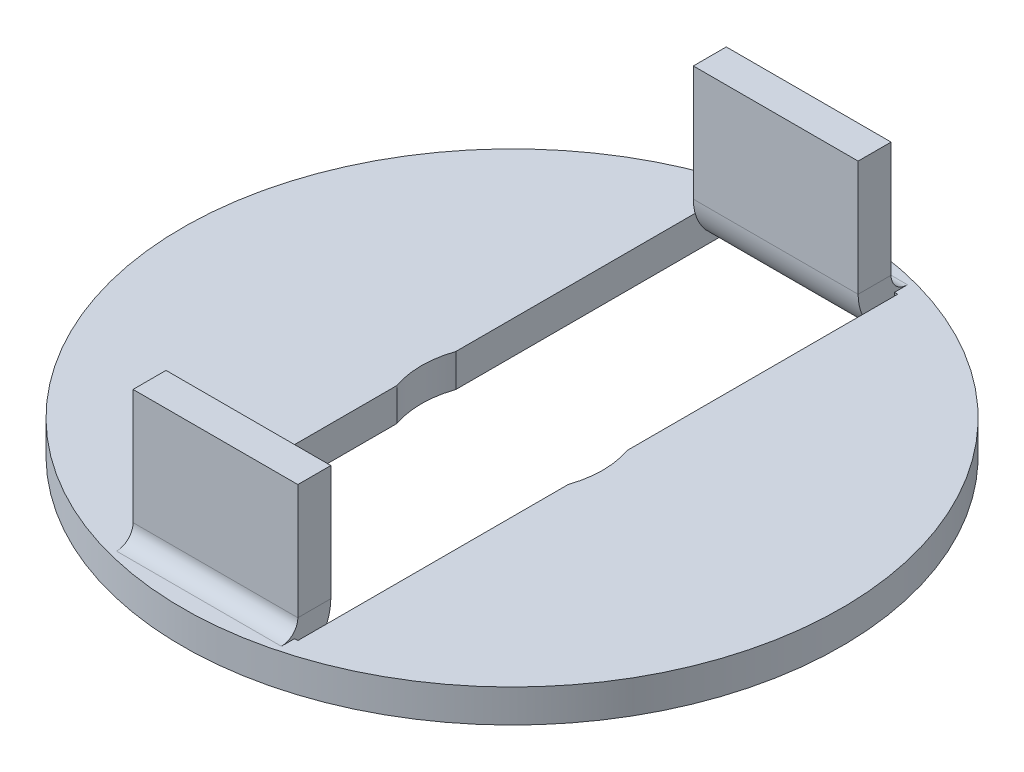
ISO-10303-21;
HEADER;
FILE_DESCRIPTION(('STEP AP214'),'2;1');
FILE_NAME('part.step','',(''),(''),'','','');
FILE_SCHEMA(('AUTOMOTIVE_DESIGN { 1 0 10303 214 1 1 1 1 }'));
ENDSEC;
DATA;
#1=APPLICATION_CONTEXT('core data for automotive mechanical design processes');
#2=APPLICATION_PROTOCOL_DEFINITION('international standard','automotive_design',2000,#1);
#3=PRODUCT_CONTEXT('',#1,'mechanical');
#4=PRODUCT('Part','Part','',(#3));
#5=PRODUCT_RELATED_PRODUCT_CATEGORY('part','',(#4));
#6=PRODUCT_DEFINITION_FORMATION('','',#4);
#7=PRODUCT_DEFINITION_CONTEXT('part definition',#1,'design');
#8=PRODUCT_DEFINITION('design','',#6,#7);
#9=PRODUCT_DEFINITION_SHAPE('','',#8);
#10=(LENGTH_UNIT() NAMED_UNIT(*) SI_UNIT(.MILLI.,.METRE.));
#11=(NAMED_UNIT(*) PLANE_ANGLE_UNIT() SI_UNIT($,.RADIAN.));
#12=(NAMED_UNIT(*) SI_UNIT($,.STERADIAN.) SOLID_ANGLE_UNIT());
#13=UNCERTAINTY_MEASURE_WITH_UNIT(LENGTH_MEASURE(1.E-05),#10,'distance_accuracy_value','');
#14=(GEOMETRIC_REPRESENTATION_CONTEXT(3) GLOBAL_UNCERTAINTY_ASSIGNED_CONTEXT((#13)) GLOBAL_UNIT_ASSIGNED_CONTEXT((#10,
#11,#12)) REPRESENTATION_CONTEXT('',''));
#15=CARTESIAN_POINT('',(0.,0.,0.));
#16=DIRECTION('',(0.,0.,1.));
#17=DIRECTION('',(1.,0.,0.));
#18=AXIS2_PLACEMENT_3D('',#15,#16,#17);
#19=CARTESIAN_POINT('',(-2.5,4.,-8.));
#20=DIRECTION('',(0.,0.,-1.));
#21=DIRECTION('',(-1.,0.,0.));
#22=AXIS2_PLACEMENT_3D('',#19,#20,#21);
#23=PLANE('',#22);
#24=DIRECTION('',(-1.,0.,0.));
#25=VECTOR('',#24,1.);
#26=CARTESIAN_POINT('',(-2.5,0.499999999999998,-8.));
#27=LINE('',#26,#25);
#28=CARTESIAN_POINT('',(-2.5,0.499999999999998,-8.));
#29=VERTEX_POINT('',#28);
#30=CARTESIAN_POINT('',(2.5,0.499999999999998,-8.));
#31=VERTEX_POINT('',#30);
#32=EDGE_CURVE('E373',#29,#31,#27,.F.);
#33=ORIENTED_EDGE('',*,*,#32,.T.);
#34=DIRECTION('',(0.,-1.,0.));
#35=VECTOR('',#34,1.);
#36=CARTESIAN_POINT('',(2.5,4.,-8.));
#37=LINE('',#36,#35);
#38=CARTESIAN_POINT('',(2.5,4.,-8.));
#39=VERTEX_POINT('',#38);
#40=EDGE_CURVE('E11',#39,#31,#37,.T.);
#41=ORIENTED_EDGE('',*,*,#40,.F.);
#42=DIRECTION('',(1.,0.,0.));
#43=VECTOR('',#42,1.);
#44=CARTESIAN_POINT('',(-2.5,4.,-8.));
#45=LINE('',#44,#43);
#46=CARTESIAN_POINT('',(-2.5,4.,-8.));
#47=VERTEX_POINT('',#46);
#48=EDGE_CURVE('E393',#47,#39,#45,.T.);
#49=ORIENTED_EDGE('',*,*,#48,.F.);
#50=DIRECTION('',(0.,-1.,0.));
#51=VECTOR('',#50,1.);
#52=CARTESIAN_POINT('',(-2.5,4.,-8.));
#53=LINE('',#52,#51);
#54=EDGE_CURVE('E51',#47,#29,#53,.T.);
#55=ORIENTED_EDGE('',*,*,#54,.T.);
#56=EDGE_LOOP('',(#33,#41,#49,#55));
#57=FACE_BOUND('',#56,.T.);
#58=ADVANCED_FACE('F37',(#57),#23,.F.);
#59=CARTESIAN_POINT('',(-2.5,4.,-9.));
#60=DIRECTION('',(0.,0.,-1.));
#61=DIRECTION('',(-1.,0.,0.));
#62=AXIS2_PLACEMENT_3D('',#59,#60,#61);
#63=PLANE('',#62);
#64=DIRECTION('',(0.,-1.,0.));
#65=VECTOR('',#64,1.);
#66=CARTESIAN_POINT('',(2.5,4.,-9.));
#67=LINE('',#66,#65);
#68=CARTESIAN_POINT('',(2.5,4.,-9.));
#69=VERTEX_POINT('',#68);
#70=CARTESIAN_POINT('',(2.5,0.499999999999998,-9.));
#71=VERTEX_POINT('',#70);
#72=EDGE_CURVE('E44',#69,#71,#67,.T.);
#73=ORIENTED_EDGE('',*,*,#72,.T.);
#74=DIRECTION('',(-1.,0.,0.));
#75=VECTOR('',#74,1.);
#76=CARTESIAN_POINT('',(-2.5,0.499999999999998,-9.));
#77=LINE('',#76,#75);
#78=CARTESIAN_POINT('',(-2.5,0.499999999999998,-9.));
#79=VERTEX_POINT('',#78);
#80=EDGE_CURVE('E385',#79,#71,#77,.F.);
#81=ORIENTED_EDGE('',*,*,#80,.F.);
#82=DIRECTION('',(0.,-1.,0.));
#83=VECTOR('',#82,1.);
#84=CARTESIAN_POINT('',(-2.5,4.,-9.));
#85=LINE('',#84,#83);
#86=CARTESIAN_POINT('',(-2.5,4.,-9.));
#87=VERTEX_POINT('',#86);
#88=EDGE_CURVE('E59',#87,#79,#85,.T.);
#89=ORIENTED_EDGE('',*,*,#88,.F.);
#90=DIRECTION('',(1.,0.,0.));
#91=VECTOR('',#90,1.);
#92=CARTESIAN_POINT('',(-2.5,4.,-9.));
#93=LINE('',#92,#91);
#94=EDGE_CURVE('E399',#87,#69,#93,.T.);
#95=ORIENTED_EDGE('',*,*,#94,.T.);
#96=EDGE_LOOP('',(#73,#81,#89,#95));
#97=FACE_BOUND('',#96,.T.);
#98=ADVANCED_FACE('F405',(#97),#63,.T.);
#99=CARTESIAN_POINT('',(-2.5,4.,-8.));
#100=DIRECTION('',(-1.,0.,0.));
#101=DIRECTION('',(0.,0.,1.));
#102=AXIS2_PLACEMENT_3D('',#99,#100,#101);
#103=PLANE('',#102);
#104=ORIENTED_EDGE('',*,*,#88,.T.);
#105=DIRECTION('',(0.,0.,1.));
#106=VECTOR('',#105,1.);
#107=CARTESIAN_POINT('',(-2.5,0.499999999999998,-9.));
#108=LINE('',#107,#106);
#109=EDGE_CURVE('E379',#79,#29,#108,.T.);
#110=ORIENTED_EDGE('',*,*,#109,.T.);
#111=ORIENTED_EDGE('',*,*,#54,.F.);
#112=DIRECTION('',(0.,0.,-1.));
#113=VECTOR('',#112,1.);
#114=CARTESIAN_POINT('',(-2.5,4.,-8.));
#115=LINE('',#114,#113);
#116=EDGE_CURVE('E401',#47,#87,#115,.T.);
#117=ORIENTED_EDGE('',*,*,#116,.T.);
#118=EDGE_LOOP('',(#104,#110,#111,#117));
#119=FACE_BOUND('',#118,.T.);
#120=ADVANCED_FACE('F517',(#119),#103,.T.);
#121=CARTESIAN_POINT('',(2.5,4.,-9.));
#122=DIRECTION('',(1.,0.,0.));
#123=DIRECTION('',(0.,0.,-1.));
#124=AXIS2_PLACEMENT_3D('',#121,#122,#123);
#125=PLANE('',#124);
#126=DIRECTION('',(0.,0.,1.));
#127=VECTOR('',#126,1.);
#128=CARTESIAN_POINT('',(2.5,0.499999999999998,-9.));
#129=LINE('',#128,#127);
#130=EDGE_CURVE('E390',#71,#31,#129,.T.);
#131=ORIENTED_EDGE('',*,*,#130,.F.);
#132=ORIENTED_EDGE('',*,*,#72,.F.);
#133=DIRECTION('',(0.,0.,1.));
#134=VECTOR('',#133,1.);
#135=CARTESIAN_POINT('',(2.5,4.,-9.));
#136=LINE('',#135,#134);
#137=EDGE_CURVE('E396',#69,#39,#136,.T.);
#138=ORIENTED_EDGE('',*,*,#137,.T.);
#139=ORIENTED_EDGE('',*,*,#40,.T.);
#140=EDGE_LOOP('',(#131,#132,#138,#139));
#141=FACE_BOUND('',#140,.T.);
#142=ADVANCED_FACE('F522',(#141),#125,.T.);
#143=CARTESIAN_POINT('',(0.,4.,0.));
#144=DIRECTION('',(0.,-1.,0.));
#145=DIRECTION('',(-1.,0.,0.));
#146=AXIS2_PLACEMENT_3D('',#143,#144,#145);
#147=PLANE('',#146);
#148=ORIENTED_EDGE('',*,*,#48,.T.);
#149=ORIENTED_EDGE('',*,*,#137,.F.);
#150=ORIENTED_EDGE('',*,*,#94,.F.);
#151=ORIENTED_EDGE('',*,*,#116,.F.);
#152=EDGE_LOOP('',(#148,#149,#150,#151));
#153=FACE_BOUND('',#152,.T.);
#154=ADVANCED_FACE('F524',(#153),#147,.F.);
#155=CARTESIAN_POINT('',(2.5,0.499999999999998,-9.5));
#156=DIRECTION('',(1.,0.,0.));
#157=DIRECTION('',(0.,0.,-1.));
#158=AXIS2_PLACEMENT_3D('',#155,#156,#157);
#159=PLANE('',#158);
#160=DIRECTION('',(0.,-1.,0.));
#161=VECTOR('',#160,1.);
#162=CARTESIAN_POINT('',(2.5,0.,-9.5));
#163=LINE('',#162,#161);
#164=CARTESIAN_POINT('',(2.5,0.,-9.5));
#165=VERTEX_POINT('',#164);
#166=CARTESIAN_POINT('',(2.5,-1.,-9.5));
#167=VERTEX_POINT('',#166);
#168=EDGE_CURVE('E301',#165,#167,#163,.T.);
#169=ORIENTED_EDGE('',*,*,#168,.F.);
#170=CARTESIAN_POINT('',(2.5,0.499999999999998,-9.5));
#171=DIRECTION('',(-1.,0.,0.));
#172=DIRECTION('',(0.,0.,1.));
#173=AXIS2_PLACEMENT_3D('',#170,#171,#172);
#174=CIRCLE('',#173,0.5);
#175=EDGE_CURVE('E382',#71,#165,#174,.F.);
#176=ORIENTED_EDGE('',*,*,#175,.F.);
#177=ORIENTED_EDGE('',*,*,#130,.T.);
#178=CARTESIAN_POINT('',(2.5,0.499999999999998,-9.5));
#179=DIRECTION('',(-1.,0.,0.));
#180=DIRECTION('',(0.,0.,1.));
#181=AXIS2_PLACEMENT_3D('',#178,#179,#180);
#182=CIRCLE('',#181,1.5);
#183=EDGE_CURVE('E375',#31,#167,#182,.F.);
#184=ORIENTED_EDGE('',*,*,#183,.T.);
#185=EDGE_LOOP('',(#169,#176,#177,#184));
#186=FACE_BOUND('',#185,.T.);
#187=ADVANCED_FACE('F414',(#186),#159,.T.);
#188=CARTESIAN_POINT('',(-2.5,0.499999999999998,-9.5));
#189=DIRECTION('',(1.,0.,0.));
#190=DIRECTION('',(0.,0.,-1.));
#191=AXIS2_PLACEMENT_3D('',#188,#189,#190);
#192=PLANE('',#191);
#193=CARTESIAN_POINT('',(-2.5,0.499999999999998,-9.5));
#194=DIRECTION('',(-1.,0.,0.));
#195=DIRECTION('',(0.,0.,1.));
#196=AXIS2_PLACEMENT_3D('',#193,#194,#195);
#197=CIRCLE('',#196,0.5);
#198=CARTESIAN_POINT('',(-2.5,0.,-9.5));
#199=VERTEX_POINT('',#198);
#200=EDGE_CURVE('E372',#199,#79,#197,.T.);
#201=ORIENTED_EDGE('',*,*,#200,.F.);
#202=DIRECTION('',(0.,-1.,0.));
#203=VECTOR('',#202,1.);
#204=CARTESIAN_POINT('',(-2.5,0.,-9.5));
#205=LINE('',#204,#203);
#206=CARTESIAN_POINT('',(-2.5,-1.,-9.5));
#207=VERTEX_POINT('',#206);
#208=EDGE_CURVE('E304',#199,#207,#205,.T.);
#209=ORIENTED_EDGE('',*,*,#208,.T.);
#210=CARTESIAN_POINT('',(-2.5,0.499999999999998,-9.5));
#211=DIRECTION('',(-1.,0.,0.));
#212=DIRECTION('',(0.,0.,1.));
#213=AXIS2_PLACEMENT_3D('',#210,#211,#212);
#214=CIRCLE('',#213,1.5);
#215=EDGE_CURVE('E376',#207,#29,#214,.T.);
#216=ORIENTED_EDGE('',*,*,#215,.T.);
#217=ORIENTED_EDGE('',*,*,#109,.F.);
#218=EDGE_LOOP('',(#201,#209,#216,#217));
#219=FACE_BOUND('',#218,.T.);
#220=ADVANCED_FACE('F434',(#219),#192,.F.);
#221=CARTESIAN_POINT('',(-2.5,0.499999999999998,-9.5));
#222=DIRECTION('',(-1.,0.,0.));
#223=DIRECTION('',(0.,-1.,0.));
#224=AXIS2_PLACEMENT_3D('',#221,#222,#223);
#225=CYLINDRICAL_SURFACE('',#224,1.5);
#226=ORIENTED_EDGE('',*,*,#32,.F.);
#227=ORIENTED_EDGE('',*,*,#215,.F.);
#228=DIRECTION('',(-1.,0.,0.));
#229=VECTOR('',#228,1.);
#230=CARTESIAN_POINT('',(0.,-1.,-9.5));
#231=LINE('',#230,#229);
#232=EDGE_CURVE('E317',#167,#207,#231,.T.);
#233=ORIENTED_EDGE('',*,*,#232,.F.);
#234=ORIENTED_EDGE('',*,*,#183,.F.);
#235=EDGE_LOOP('',(#226,#227,#233,#234));
#236=FACE_BOUND('',#235,.T.);
#237=ADVANCED_FACE('F536',(#236),#225,.T.);
#238=CARTESIAN_POINT('',(-2.5,0.499999999999998,-9.5));
#239=DIRECTION('',(-1.,0.,0.));
#240=DIRECTION('',(0.,-1.,0.));
#241=AXIS2_PLACEMENT_3D('',#238,#239,#240);
#242=CYLINDRICAL_SURFACE('',#241,0.5);
#243=ORIENTED_EDGE('',*,*,#80,.T.);
#244=ORIENTED_EDGE('',*,*,#175,.T.);
#245=DIRECTION('',(-1.,0.,0.));
#246=VECTOR('',#245,1.);
#247=CARTESIAN_POINT('',(2.5,0.,-9.5));
#248=LINE('',#247,#246);
#249=EDGE_CURVE('E302',#165,#199,#248,.T.);
#250=ORIENTED_EDGE('',*,*,#249,.T.);
#251=ORIENTED_EDGE('',*,*,#200,.T.);
#252=EDGE_LOOP('',(#243,#244,#250,#251));
#253=FACE_BOUND('',#252,.T.);
#254=ADVANCED_FACE('F410',(#253),#242,.F.);
#255=CARTESIAN_POINT('',(-2.5,-1.,-9.1));
#256=DIRECTION('',(0.,0.,-1.));
#257=DIRECTION('',(0.,1.,0.));
#258=AXIS2_PLACEMENT_3D('',#255,#256,#257);
#259=PLANE('',#258);
#260=DIRECTION('',(-1.,0.,0.));
#261=VECTOR('',#260,1.);
#262=CARTESIAN_POINT('',(-2.5,0.,-9.1));
#263=LINE('',#262,#261);
#264=CARTESIAN_POINT('',(-2.5,0.,-9.1));
#265=VERTEX_POINT('',#264);
#266=CARTESIAN_POINT('',(-2.6,0.,-9.1));
#267=VERTEX_POINT('',#266);
#268=EDGE_CURVE('E320',#265,#267,#263,.T.);
#269=ORIENTED_EDGE('',*,*,#268,.T.);
#270=DIRECTION('',(0.,1.,0.));
#271=VECTOR('',#270,1.);
#272=CARTESIAN_POINT('',(-2.6,-1.,-9.1));
#273=LINE('',#272,#271);
#274=CARTESIAN_POINT('',(-2.6,-1.,-9.1));
#275=VERTEX_POINT('',#274);
#276=EDGE_CURVE('E363',#275,#267,#273,.T.);
#277=ORIENTED_EDGE('',*,*,#276,.F.);
#278=DIRECTION('',(-1.,0.,0.));
#279=VECTOR('',#278,1.);
#280=CARTESIAN_POINT('',(-2.5,-1.,-9.1));
#281=LINE('',#280,#279);
#282=CARTESIAN_POINT('',(-2.5,-1.,-9.1));
#283=VERTEX_POINT('',#282);
#284=EDGE_CURVE('E321',#283,#275,#281,.T.);
#285=ORIENTED_EDGE('',*,*,#284,.F.);
#286=DIRECTION('',(0.,1.,0.));
#287=VECTOR('',#286,1.);
#288=CARTESIAN_POINT('',(-2.5,-1.,-9.1));
#289=LINE('',#288,#287);
#290=EDGE_CURVE('E366',#283,#265,#289,.T.);
#291=ORIENTED_EDGE('',*,*,#290,.T.);
#292=EDGE_LOOP('',(#269,#277,#285,#291));
#293=FACE_BOUND('',#292,.T.);
#294=ADVANCED_FACE('F440',(#293),#259,.F.);
#295=CARTESIAN_POINT('',(-2.6,-1.,-9.1));
#296=DIRECTION('',(-1.,0.,0.));
#297=DIRECTION('',(0.,0.,1.));
#298=AXIS2_PLACEMENT_3D('',#295,#296,#297);
#299=PLANE('',#298);
#300=DIRECTION('',(0.,0.,1.));
#301=VECTOR('',#300,1.);
#302=CARTESIAN_POINT('',(-2.6,0.,-9.1));
#303=LINE('',#302,#301);
#304=CARTESIAN_POINT('',(-2.6,0.,-0.895823643358447));
#305=VERTEX_POINT('',#304);
#306=EDGE_CURVE('E340',#267,#305,#303,.T.);
#307=ORIENTED_EDGE('',*,*,#306,.T.);
#308=DIRECTION('',(0.,1.,0.));
#309=VECTOR('',#308,1.);
#310=CARTESIAN_POINT('',(-2.6,-0.999999999999972,-0.895823643358443));
#311=LINE('',#310,#309);
#312=CARTESIAN_POINT('',(-2.6,-0.999999999999972,-0.895823643358443));
#313=VERTEX_POINT('',#312);
#314=EDGE_CURVE('E360',#313,#305,#311,.T.);
#315=ORIENTED_EDGE('',*,*,#314,.F.);
#316=DIRECTION('',(0.,0.,1.));
#317=VECTOR('',#316,1.);
#318=CARTESIAN_POINT('',(-2.6,-1.,-9.1));
#319=LINE('',#318,#317);
#320=EDGE_CURVE('E323',#275,#313,#319,.T.);
#321=ORIENTED_EDGE('',*,*,#320,.F.);
#322=ORIENTED_EDGE('',*,*,#276,.T.);
#323=EDGE_LOOP('',(#307,#315,#321,#322));
#324=FACE_BOUND('',#323,.T.);
#325=ADVANCED_FACE('F445',(#324),#299,.F.);
#326=CARTESIAN_POINT('',(0.,-0.999999999999969,0.));
#327=DIRECTION('',(0.,1.,0.));
#328=DIRECTION('',(0.,0.,1.));
#329=AXIS2_PLACEMENT_3D('',#326,#327,#328);
#330=CYLINDRICAL_SURFACE('',#329,2.75);
#331=CARTESIAN_POINT('',(0.,0.,0.));
#332=DIRECTION('',(0.,1.,0.));
#333=DIRECTION('',(0.,0.,-1.));
#334=AXIS2_PLACEMENT_3D('',#331,#332,#333);
#335=CIRCLE('',#334,2.75);
#336=CARTESIAN_POINT('',(-2.6,0.,0.895823643358449));
#337=VERTEX_POINT('',#336);
#338=EDGE_CURVE('E342',#305,#337,#335,.T.);
#339=ORIENTED_EDGE('',*,*,#338,.T.);
#340=DIRECTION('',(0.,1.,0.));
#341=VECTOR('',#340,1.);
#342=CARTESIAN_POINT('',(-2.6,-0.999999999999966,0.895823643358453));
#343=LINE('',#342,#341);
#344=CARTESIAN_POINT('',(-2.6,-0.999999999999966,0.895823643358453));
#345=VERTEX_POINT('',#344);
#346=EDGE_CURVE('E247',#345,#337,#343,.T.);
#347=ORIENTED_EDGE('',*,*,#346,.F.);
#348=CARTESIAN_POINT('',(0.,-0.999999999999969,0.));
#349=DIRECTION('',(0.,1.,0.));
#350=DIRECTION('',(0.,0.,-1.));
#351=AXIS2_PLACEMENT_3D('',#348,#349,#350);
#352=CIRCLE('',#351,2.75);
#353=EDGE_CURVE('E326',#313,#345,#352,.T.);
#354=ORIENTED_EDGE('',*,*,#353,.F.);
#355=ORIENTED_EDGE('',*,*,#314,.T.);
#356=EDGE_LOOP('',(#339,#347,#354,#355));
#357=FACE_BOUND('',#356,.T.);
#358=ADVANCED_FACE('F452',(#357),#330,.F.);
#359=CARTESIAN_POINT('',(0.,-0.999999999999969,0.));
#360=DIRECTION('',(0.,1.,0.));
#361=DIRECTION('',(0.,0.,1.));
#362=AXIS2_PLACEMENT_3D('',#359,#360,#361);
#363=CYLINDRICAL_SURFACE('',#362,10.);
#364=CARTESIAN_POINT('',(0.,0.,0.));
#365=DIRECTION('',(0.,-1.,0.));
#366=DIRECTION('',(0.,0.,-1.));
#367=AXIS2_PLACEMENT_3D('',#364,#365,#366);
#368=CIRCLE('',#367,10.);
#369=CARTESIAN_POINT('',(0.,0.,-10.));
#370=VERTEX_POINT('',#369);
#371=EDGE_CURVE('E344',#370,#370,#368,.T.);
#372=ORIENTED_EDGE('',*,*,#371,.T.);
#373=EDGE_LOOP('',(#372));
#374=FACE_BOUND('',#373,.T.);
#375=CARTESIAN_POINT('',(0.,-0.999999999999969,0.));
#376=DIRECTION('',(0.,-1.,0.));
#377=DIRECTION('',(0.,0.,-1.));
#378=AXIS2_PLACEMENT_3D('',#375,#376,#377);
#379=CIRCLE('',#378,10.);
#380=CARTESIAN_POINT('',(0.,-1.,-10.));
#381=VERTEX_POINT('',#380);
#382=EDGE_CURVE('E328',#381,#381,#379,.T.);
#383=ORIENTED_EDGE('',*,*,#382,.F.);
#384=EDGE_LOOP('',(#383));
#385=FACE_BOUND('',#384,.T.);
#386=ADVANCED_FACE('F549',(#374,#385),#363,.T.);
#387=CARTESIAN_POINT('',(0.,-0.999999999999969,0.));
#388=DIRECTION('',(0.,1.,0.));
#389=DIRECTION('',(0.,0.,1.));
#390=AXIS2_PLACEMENT_3D('',#387,#388,#389);
#391=CYLINDRICAL_SURFACE('',#390,2.75);
#392=CARTESIAN_POINT('',(0.,0.,0.));
#393=DIRECTION('',(0.,1.,0.));
#394=DIRECTION('',(0.,0.,-1.));
#395=AXIS2_PLACEMENT_3D('',#392,#393,#394);
#396=CIRCLE('',#395,2.75);
#397=CARTESIAN_POINT('',(2.6,0.,0.895823643358441));
#398=VERTEX_POINT('',#397);
#399=CARTESIAN_POINT('',(2.6,0.,-0.895823643358443));
#400=VERTEX_POINT('',#399);
#401=EDGE_CURVE('E347',#398,#400,#396,.T.);
#402=ORIENTED_EDGE('',*,*,#401,.T.);
#403=DIRECTION('',(0.,1.,0.));
#404=VECTOR('',#403,1.);
#405=CARTESIAN_POINT('',(2.6,-0.999999999999972,-0.89582364335844));
#406=LINE('',#405,#404);
#407=CARTESIAN_POINT('',(2.6,-0.999999999999972,-0.89582364335844));
#408=VERTEX_POINT('',#407);
#409=EDGE_CURVE('E357',#408,#400,#406,.T.);
#410=ORIENTED_EDGE('',*,*,#409,.F.);
#411=CARTESIAN_POINT('',(0.,-0.999999999999969,0.));
#412=DIRECTION('',(0.,1.,0.));
#413=DIRECTION('',(0.,0.,-1.));
#414=AXIS2_PLACEMENT_3D('',#411,#412,#413);
#415=CIRCLE('',#414,2.75);
#416=CARTESIAN_POINT('',(2.6,-0.999999999999966,0.895823643358444));
#417=VERTEX_POINT('',#416);
#418=EDGE_CURVE('E331',#417,#408,#415,.T.);
#419=ORIENTED_EDGE('',*,*,#418,.F.);
#420=DIRECTION('',(0.,1.,0.));
#421=VECTOR('',#420,1.);
#422=CARTESIAN_POINT('',(2.6,-0.999999999999966,0.895823643358444));
#423=LINE('',#422,#421);
#424=EDGE_CURVE('E244',#417,#398,#423,.T.);
#425=ORIENTED_EDGE('',*,*,#424,.T.);
#426=EDGE_LOOP('',(#402,#410,#419,#425));
#427=FACE_BOUND('',#426,.T.);
#428=ADVANCED_FACE('F552',(#427),#391,.F.);
#429=CARTESIAN_POINT('',(2.6,-1.,-9.1));
#430=DIRECTION('',(1.,0.,0.));
#431=DIRECTION('',(0.,0.,-1.));
#432=AXIS2_PLACEMENT_3D('',#429,#430,#431);
#433=PLANE('',#432);
#434=DIRECTION('',(0.,0.,-1.));
#435=VECTOR('',#434,1.);
#436=CARTESIAN_POINT('',(2.6,0.,-9.1));
#437=LINE('',#436,#435);
#438=CARTESIAN_POINT('',(2.6,0.,-9.1));
#439=VERTEX_POINT('',#438);
#440=EDGE_CURVE('E349',#400,#439,#437,.T.);
#441=ORIENTED_EDGE('',*,*,#440,.T.);
#442=DIRECTION('',(0.,1.,0.));
#443=VECTOR('',#442,1.);
#444=CARTESIAN_POINT('',(2.6,-1.,-9.1));
#445=LINE('',#444,#443);
#446=CARTESIAN_POINT('',(2.6,-1.,-9.1));
#447=VERTEX_POINT('',#446);
#448=EDGE_CURVE('E354',#447,#439,#445,.T.);
#449=ORIENTED_EDGE('',*,*,#448,.F.);
#450=DIRECTION('',(0.,0.,-1.));
#451=VECTOR('',#450,1.);
#452=CARTESIAN_POINT('',(2.6,-1.,-9.1));
#453=LINE('',#452,#451);
#454=EDGE_CURVE('E333',#408,#447,#453,.T.);
#455=ORIENTED_EDGE('',*,*,#454,.F.);
#456=ORIENTED_EDGE('',*,*,#409,.T.);
#457=EDGE_LOOP('',(#441,#449,#455,#456));
#458=FACE_BOUND('',#457,.T.);
#459=ADVANCED_FACE('F556',(#458),#433,.F.);
#460=CARTESIAN_POINT('',(2.5,-1.,-9.1));
#461=DIRECTION('',(0.,0.,-1.));
#462=DIRECTION('',(0.,1.,0.));
#463=AXIS2_PLACEMENT_3D('',#460,#461,#462);
#464=PLANE('',#463);
#465=DIRECTION('',(-1.,0.,0.));
#466=VECTOR('',#465,1.);
#467=CARTESIAN_POINT('',(2.5,0.,-9.1));
#468=LINE('',#467,#466);
#469=CARTESIAN_POINT('',(2.5,0.,-9.1));
#470=VERTEX_POINT('',#469);
#471=EDGE_CURVE('E324',#439,#470,#468,.T.);
#472=ORIENTED_EDGE('',*,*,#471,.T.);
#473=DIRECTION('',(0.,1.,0.));
#474=VECTOR('',#473,1.);
#475=CARTESIAN_POINT('',(2.5,-1.,-9.1));
#476=LINE('',#475,#474);
#477=CARTESIAN_POINT('',(2.5,-1.,-9.1));
#478=VERTEX_POINT('',#477);
#479=EDGE_CURVE('E338',#478,#470,#476,.T.);
#480=ORIENTED_EDGE('',*,*,#479,.F.);
#481=DIRECTION('',(-1.,0.,0.));
#482=VECTOR('',#481,1.);
#483=CARTESIAN_POINT('',(2.5,-1.,-9.1));
#484=LINE('',#483,#482);
#485=EDGE_CURVE('E335',#447,#478,#484,.T.);
#486=ORIENTED_EDGE('',*,*,#485,.F.);
#487=ORIENTED_EDGE('',*,*,#448,.T.);
#488=EDGE_LOOP('',(#472,#480,#486,#487));
#489=FACE_BOUND('',#488,.T.);
#490=ADVANCED_FACE('F425',(#489),#464,.F.);
#491=CARTESIAN_POINT('',(0.,-0.999999999999969,0.));
#492=DIRECTION('',(0.,-1.,0.));
#493=DIRECTION('',(0.,0.,-1.));
#494=AXIS2_PLACEMENT_3D('',#491,#492,#493);
#495=PLANE('',#494);
#496=ORIENTED_EDGE('',*,*,#382,.T.);
#497=EDGE_LOOP('',(#496));
#498=FACE_BOUND('',#497,.T.);
#499=DIRECTION('',(0.,0.,-1.));
#500=VECTOR('',#499,1.);
#501=CARTESIAN_POINT('',(-2.5,-0.999999999999969,0.));
#502=LINE('',#501,#500);
#503=EDGE_CURVE('E314',#283,#207,#502,.T.);
#504=ORIENTED_EDGE('',*,*,#503,.F.);
#505=ORIENTED_EDGE('',*,*,#284,.T.);
#506=ORIENTED_EDGE('',*,*,#320,.T.);
#507=ORIENTED_EDGE('',*,*,#353,.T.);
#508=DIRECTION('',(0.,0.,-1.));
#509=VECTOR('',#508,1.);
#510=CARTESIAN_POINT('',(-2.59999999999999,-0.999999999999937,9.1));
#511=LINE('',#510,#509);
#512=CARTESIAN_POINT('',(-2.59999999999999,-0.999999999999937,9.1));
#513=VERTEX_POINT('',#512);
#514=EDGE_CURVE('E227',#513,#345,#511,.T.);
#515=ORIENTED_EDGE('',*,*,#514,.F.);
#516=DIRECTION('',(-1.,0.,0.));
#517=VECTOR('',#516,1.);
#518=CARTESIAN_POINT('',(-2.49999999999999,-0.999999999999937,9.1));
#519=LINE('',#518,#517);
#520=CARTESIAN_POINT('',(-2.49999999999999,-0.999999999999937,9.1));
#521=VERTEX_POINT('',#520);
#522=EDGE_CURVE('E241',#521,#513,#519,.T.);
#523=ORIENTED_EDGE('',*,*,#522,.F.);
#524=DIRECTION('',(0.,0.,1.));
#525=VECTOR('',#524,1.);
#526=CARTESIAN_POINT('',(-2.5,-0.999999999999969,0.));
#527=LINE('',#526,#525);
#528=CARTESIAN_POINT('',(-2.49999999999999,-0.999999999999934,9.50000000000001));
#529=VERTEX_POINT('',#528);
#530=EDGE_CURVE('E211',#521,#529,#527,.T.);
#531=ORIENTED_EDGE('',*,*,#530,.T.);
#532=DIRECTION('',(-1.,0.,0.));
#533=VECTOR('',#532,1.);
#534=CARTESIAN_POINT('',(0.,-0.999999999999935,9.5));
#535=LINE('',#534,#533);
#536=CARTESIAN_POINT('',(2.50000000000001,-0.999999999999935,9.5));
#537=VERTEX_POINT('',#536);
#538=EDGE_CURVE('E207',#537,#529,#535,.T.);
#539=ORIENTED_EDGE('',*,*,#538,.F.);
#540=DIRECTION('',(0.,0.,-1.));
#541=VECTOR('',#540,1.);
#542=CARTESIAN_POINT('',(2.5,-0.999999999999969,0.));
#543=LINE('',#542,#541);
#544=CARTESIAN_POINT('',(2.50000000000001,-0.999999999999937,9.1));
#545=VERTEX_POINT('',#544);
#546=EDGE_CURVE('E198',#537,#545,#543,.T.);
#547=ORIENTED_EDGE('',*,*,#546,.T.);
#548=DIRECTION('',(-1.,0.,0.));
#549=VECTOR('',#548,1.);
#550=CARTESIAN_POINT('',(2.50000000000001,-0.999999999999937,9.1));
#551=LINE('',#550,#549);
#552=CARTESIAN_POINT('',(2.60000000000001,-0.999999999999937,9.1));
#553=VERTEX_POINT('',#552);
#554=EDGE_CURVE('E204',#553,#545,#551,.T.);
#555=ORIENTED_EDGE('',*,*,#554,.F.);
#556=DIRECTION('',(0.,0.,1.));
#557=VECTOR('',#556,1.);
#558=CARTESIAN_POINT('',(2.60000000000001,-0.999999999999937,9.1));
#559=LINE('',#558,#557);
#560=EDGE_CURVE('E225',#417,#553,#559,.T.);
#561=ORIENTED_EDGE('',*,*,#560,.F.);
#562=ORIENTED_EDGE('',*,*,#418,.T.);
#563=ORIENTED_EDGE('',*,*,#454,.T.);
#564=ORIENTED_EDGE('',*,*,#485,.T.);
#565=DIRECTION('',(0.,0.,1.));
#566=VECTOR('',#565,1.);
#567=CARTESIAN_POINT('',(2.5,-0.999999999999969,0.));
#568=LINE('',#567,#566);
#569=EDGE_CURVE('E312',#167,#478,#568,.T.);
#570=ORIENTED_EDGE('',*,*,#569,.F.);
#571=ORIENTED_EDGE('',*,*,#232,.T.);
#572=EDGE_LOOP('',(#504,#505,#506,#507,#515,#523,#531,#539,#547,#555,#561,#562,#563,#564,#570,#571));
#573=FACE_BOUND('',#572,.T.);
#574=ADVANCED_FACE('F201',(#498,#573),#495,.T.);
#575=CARTESIAN_POINT('',(0.,0.,0.));
#576=DIRECTION('',(0.,-1.,0.));
#577=DIRECTION('',(0.,0.,-1.));
#578=AXIS2_PLACEMENT_3D('',#575,#576,#577);
#579=PLANE('',#578);
#580=ORIENTED_EDGE('',*,*,#371,.F.);
#581=EDGE_LOOP('',(#580));
#582=FACE_BOUND('',#581,.T.);
#583=ORIENTED_EDGE('',*,*,#268,.F.);
#584=DIRECTION('',(0.,0.,-1.));
#585=VECTOR('',#584,1.);
#586=CARTESIAN_POINT('',(-2.5,0.,0.));
#587=LINE('',#586,#585);
#588=EDGE_CURVE('E369',#265,#199,#587,.T.);
#589=ORIENTED_EDGE('',*,*,#588,.T.);
#590=ORIENTED_EDGE('',*,*,#249,.F.);
#591=DIRECTION('',(0.,0.,1.));
#592=VECTOR('',#591,1.);
#593=CARTESIAN_POINT('',(2.5,0.,-9.5));
#594=LINE('',#593,#592);
#595=EDGE_CURVE('E305',#165,#470,#594,.T.);
#596=ORIENTED_EDGE('',*,*,#595,.T.);
#597=ORIENTED_EDGE('',*,*,#471,.F.);
#598=ORIENTED_EDGE('',*,*,#440,.F.);
#599=ORIENTED_EDGE('',*,*,#401,.F.);
#600=DIRECTION('',(0.,0.,1.));
#601=VECTOR('',#600,1.);
#602=CARTESIAN_POINT('',(2.60000000000001,0.,9.1));
#603=LINE('',#602,#601);
#604=CARTESIAN_POINT('',(2.60000000000001,0.,9.1));
#605=VERTEX_POINT('',#604);
#606=EDGE_CURVE('E237',#398,#605,#603,.T.);
#607=ORIENTED_EDGE('',*,*,#606,.T.);
#608=DIRECTION('',(-1.,0.,0.));
#609=VECTOR('',#608,1.);
#610=CARTESIAN_POINT('',(2.50000000000001,0.,9.1));
#611=LINE('',#610,#609);
#612=CARTESIAN_POINT('',(2.50000000000001,0.,9.1));
#613=VERTEX_POINT('',#612);
#614=EDGE_CURVE('E240',#605,#613,#611,.T.);
#615=ORIENTED_EDGE('',*,*,#614,.T.);
#616=DIRECTION('',(0.,0.,-1.));
#617=VECTOR('',#616,1.);
#618=CARTESIAN_POINT('',(2.50000000000001,0.,9.5));
#619=LINE('',#618,#617);
#620=CARTESIAN_POINT('',(2.50000000000001,0.,9.5));
#621=VERTEX_POINT('',#620);
#622=EDGE_CURVE('E217',#621,#613,#619,.T.);
#623=ORIENTED_EDGE('',*,*,#622,.F.);
#624=DIRECTION('',(-1.,0.,0.));
#625=VECTOR('',#624,1.);
#626=CARTESIAN_POINT('',(2.50000000000001,0.,9.5));
#627=LINE('',#626,#625);
#628=CARTESIAN_POINT('',(-2.49999999999999,0.,9.5));
#629=VERTEX_POINT('',#628);
#630=EDGE_CURVE('E463',#621,#629,#627,.T.);
#631=ORIENTED_EDGE('',*,*,#630,.T.);
#632=DIRECTION('',(0.,0.,1.));
#633=VECTOR('',#632,1.);
#634=CARTESIAN_POINT('',(-2.5,0.,0.));
#635=LINE('',#634,#633);
#636=CARTESIAN_POINT('',(-2.49999999999999,0.,9.1));
#637=VERTEX_POINT('',#636);
#638=EDGE_CURVE('E256',#637,#629,#635,.T.);
#639=ORIENTED_EDGE('',*,*,#638,.F.);
#640=DIRECTION('',(-1.,0.,0.));
#641=VECTOR('',#640,1.);
#642=CARTESIAN_POINT('',(-2.49999999999999,0.,9.1));
#643=LINE('',#642,#641);
#644=CARTESIAN_POINT('',(-2.59999999999999,0.,9.1));
#645=VERTEX_POINT('',#644);
#646=EDGE_CURVE('E231',#637,#645,#643,.T.);
#647=ORIENTED_EDGE('',*,*,#646,.T.);
#648=DIRECTION('',(0.,0.,-1.));
#649=VECTOR('',#648,1.);
#650=CARTESIAN_POINT('',(-2.59999999999999,0.,9.1));
#651=LINE('',#650,#649);
#652=EDGE_CURVE('E234',#645,#337,#651,.T.);
#653=ORIENTED_EDGE('',*,*,#652,.T.);
#654=ORIENTED_EDGE('',*,*,#338,.F.);
#655=ORIENTED_EDGE('',*,*,#306,.F.);
#656=EDGE_LOOP('',(#583,#589,#590,#596,#597,#598,#599,#607,#615,#623,#631,#639,#647,#653,#654,#655));
#657=FACE_BOUND('',#656,.T.);
#658=ADVANCED_FACE('F429',(#582,#657),#579,.F.);
#659=CARTESIAN_POINT('',(-2.5,0.,-9.));
#660=DIRECTION('',(-1.,0.,0.));
#661=DIRECTION('',(0.,0.,1.));
#662=AXIS2_PLACEMENT_3D('',#659,#660,#661);
#663=PLANE('',#662);
#664=ORIENTED_EDGE('',*,*,#290,.F.);
#665=ORIENTED_EDGE('',*,*,#503,.T.);
#666=ORIENTED_EDGE('',*,*,#208,.F.);
#667=ORIENTED_EDGE('',*,*,#588,.F.);
#668=EDGE_LOOP('',(#664,#665,#666,#667));
#669=FACE_BOUND('',#668,.T.);
#670=ADVANCED_FACE('F436',(#669),#663,.F.);
#671=CARTESIAN_POINT('',(2.5,0.,-9.5));
#672=DIRECTION('',(1.,0.,0.));
#673=DIRECTION('',(0.,0.,-1.));
#674=AXIS2_PLACEMENT_3D('',#671,#672,#673);
#675=PLANE('',#674);
#676=ORIENTED_EDGE('',*,*,#479,.T.);
#677=ORIENTED_EDGE('',*,*,#595,.F.);
#678=ORIENTED_EDGE('',*,*,#168,.T.);
#679=ORIENTED_EDGE('',*,*,#569,.T.);
#680=EDGE_LOOP('',(#676,#677,#678,#679));
#681=FACE_BOUND('',#680,.T.);
#682=ADVANCED_FACE('F418',(#681),#675,.F.);
#683=CARTESIAN_POINT('',(-2.49999999999999,4.00000000000006,7.99999999999997));
#684=DIRECTION('',(0.,0.,1.));
#685=DIRECTION('',(-1.,0.,0.));
#686=AXIS2_PLACEMENT_3D('',#683,#684,#685);
#687=PLANE('',#686);
#688=DIRECTION('',(-1.,0.,0.));
#689=VECTOR('',#688,1.);
#690=CARTESIAN_POINT('',(-2.49999999999999,0.500000000000054,8.));
#691=LINE('',#690,#689);
#692=CARTESIAN_POINT('',(-2.49999999999999,0.500000000000054,8.));
#693=VERTEX_POINT('',#692);
#694=CARTESIAN_POINT('',(2.50000000000001,0.500000000000054,7.99999999999999));
#695=VERTEX_POINT('',#694);
#696=EDGE_CURVE('E259',#693,#695,#691,.F.);
#697=ORIENTED_EDGE('',*,*,#696,.F.);
#698=DIRECTION('',(0.,-1.,0.));
#699=VECTOR('',#698,1.);
#700=CARTESIAN_POINT('',(-2.49999999999999,4.00000000000006,7.99999999999997));
#701=LINE('',#700,#699);
#702=CARTESIAN_POINT('',(-2.49999999999999,4.00000000000006,7.99999999999997));
#703=VERTEX_POINT('',#702);
#704=EDGE_CURVE('E289',#703,#693,#701,.T.);
#705=ORIENTED_EDGE('',*,*,#704,.F.);
#706=DIRECTION('',(1.,0.,0.));
#707=VECTOR('',#706,1.);
#708=CARTESIAN_POINT('',(-2.49999999999999,4.00000000000006,7.99999999999997));
#709=LINE('',#708,#707);
#710=CARTESIAN_POINT('',(2.50000000000001,4.00000000000006,7.99999999999997));
#711=VERTEX_POINT('',#710);
#712=EDGE_CURVE('E277',#703,#711,#709,.T.);
#713=ORIENTED_EDGE('',*,*,#712,.T.);
#714=DIRECTION('',(0.,-1.,0.));
#715=VECTOR('',#714,1.);
#716=CARTESIAN_POINT('',(2.50000000000001,4.00000000000006,7.99999999999997));
#717=LINE('',#716,#715);
#718=EDGE_CURVE('E298',#711,#695,#717,.T.);
#719=ORIENTED_EDGE('',*,*,#718,.T.);
#720=EDGE_LOOP('',(#697,#705,#713,#719));
#721=FACE_BOUND('',#720,.T.);
#722=ADVANCED_FACE('F492',(#721),#687,.F.);
#723=CARTESIAN_POINT('',(-2.49999999999999,4.00000000000006,8.99999999999998));
#724=DIRECTION('',(0.,0.,1.));
#725=DIRECTION('',(-1.,0.,0.));
#726=AXIS2_PLACEMENT_3D('',#723,#724,#725);
#727=PLANE('',#726);
#728=DIRECTION('',(0.,-1.,0.));
#729=VECTOR('',#728,1.);
#730=CARTESIAN_POINT('',(2.50000000000001,4.00000000000006,8.99999999999997));
#731=LINE('',#730,#729);
#732=CARTESIAN_POINT('',(2.50000000000001,4.00000000000006,8.99999999999997));
#733=VERTEX_POINT('',#732);
#734=CARTESIAN_POINT('',(2.50000000000001,0.500000000000061,9.));
#735=VERTEX_POINT('',#734);
#736=EDGE_CURVE('E295',#733,#735,#731,.T.);
#737=ORIENTED_EDGE('',*,*,#736,.F.);
#738=DIRECTION('',(1.,0.,0.));
#739=VECTOR('',#738,1.);
#740=CARTESIAN_POINT('',(-2.49999999999999,4.00000000000006,8.99999999999998));
#741=LINE('',#740,#739);
#742=CARTESIAN_POINT('',(-2.49999999999999,4.00000000000006,8.99999999999998));
#743=VERTEX_POINT('',#742);
#744=EDGE_CURVE('E284',#743,#733,#741,.T.);
#745=ORIENTED_EDGE('',*,*,#744,.F.);
#746=DIRECTION('',(0.,-1.,0.));
#747=VECTOR('',#746,1.);
#748=CARTESIAN_POINT('',(-2.49999999999999,4.00000000000006,8.99999999999998));
#749=LINE('',#748,#747);
#750=CARTESIAN_POINT('',(-2.49999999999999,0.500000000000061,9.));
#751=VERTEX_POINT('',#750);
#752=EDGE_CURVE('E292',#743,#751,#749,.T.);
#753=ORIENTED_EDGE('',*,*,#752,.T.);
#754=DIRECTION('',(-1.,0.,0.));
#755=VECTOR('',#754,1.);
#756=CARTESIAN_POINT('',(-2.49999999999999,0.500000000000061,9.));
#757=LINE('',#756,#755);
#758=EDGE_CURVE('E270',#751,#735,#757,.F.);
#759=ORIENTED_EDGE('',*,*,#758,.T.);
#760=EDGE_LOOP('',(#737,#745,#753,#759));
#761=FACE_BOUND('',#760,.T.);
#762=ADVANCED_FACE('F485',(#761),#727,.T.);
#763=CARTESIAN_POINT('',(-2.49999999999999,4.00000000000006,7.99999999999997));
#764=DIRECTION('',(-1.,0.,0.));
#765=DIRECTION('',(0.,0.,-1.));
#766=AXIS2_PLACEMENT_3D('',#763,#764,#765);
#767=PLANE('',#766);
#768=ORIENTED_EDGE('',*,*,#752,.F.);
#769=DIRECTION('',(0.,0.,1.));
#770=VECTOR('',#769,1.);
#771=CARTESIAN_POINT('',(-2.49999999999999,4.00000000000006,7.99999999999997));
#772=LINE('',#771,#770);
#773=EDGE_CURVE('E287',#703,#743,#772,.T.);
#774=ORIENTED_EDGE('',*,*,#773,.F.);
#775=ORIENTED_EDGE('',*,*,#704,.T.);
#776=DIRECTION('',(0.,0.,-1.));
#777=VECTOR('',#776,1.);
#778=CARTESIAN_POINT('',(-2.49999999999999,0.500000000000061,9.));
#779=LINE('',#778,#777);
#780=EDGE_CURVE('E265',#751,#693,#779,.T.);
#781=ORIENTED_EDGE('',*,*,#780,.F.);
#782=EDGE_LOOP('',(#768,#774,#775,#781));
#783=FACE_BOUND('',#782,.T.);
#784=ADVANCED_FACE('F487',(#783),#767,.T.);
#785=CARTESIAN_POINT('',(2.50000000000001,4.00000000000006,8.99999999999997));
#786=DIRECTION('',(1.,0.,0.));
#787=DIRECTION('',(0.,0.,1.));
#788=AXIS2_PLACEMENT_3D('',#785,#786,#787);
#789=PLANE('',#788);
#790=DIRECTION('',(0.,0.,-1.));
#791=VECTOR('',#790,1.);
#792=CARTESIAN_POINT('',(2.50000000000001,0.500000000000061,9.));
#793=LINE('',#792,#791);
#794=EDGE_CURVE('E274',#735,#695,#793,.T.);
#795=ORIENTED_EDGE('',*,*,#794,.T.);
#796=ORIENTED_EDGE('',*,*,#718,.F.);
#797=DIRECTION('',(0.,0.,-1.));
#798=VECTOR('',#797,1.);
#799=CARTESIAN_POINT('',(2.50000000000001,4.00000000000006,8.99999999999997));
#800=LINE('',#799,#798);
#801=EDGE_CURVE('E282',#733,#711,#800,.T.);
#802=ORIENTED_EDGE('',*,*,#801,.F.);
#803=ORIENTED_EDGE('',*,*,#736,.T.);
#804=EDGE_LOOP('',(#795,#796,#802,#803));
#805=FACE_BOUND('',#804,.T.);
#806=ADVANCED_FACE('F499',(#805),#789,.T.);
#807=CARTESIAN_POINT('',(0.,4.,0.));
#808=DIRECTION('',(0.,-1.,0.));
#809=DIRECTION('',(-1.,0.,0.));
#810=AXIS2_PLACEMENT_3D('',#807,#808,#809);
#811=PLANE('',#810);
#812=ORIENTED_EDGE('',*,*,#712,.F.);
#813=ORIENTED_EDGE('',*,*,#773,.T.);
#814=ORIENTED_EDGE('',*,*,#744,.T.);
#815=ORIENTED_EDGE('',*,*,#801,.T.);
#816=EDGE_LOOP('',(#812,#813,#814,#815));
#817=FACE_BOUND('',#816,.T.);
#818=ADVANCED_FACE('F501',(#817),#811,.F.);
#819=CARTESIAN_POINT('',(2.50000000000001,0.500000000000065,9.5));
#820=DIRECTION('',(1.,0.,0.));
#821=DIRECTION('',(0.,0.,1.));
#822=AXIS2_PLACEMENT_3D('',#819,#820,#821);
#823=PLANE('',#822);
#824=DIRECTION('',(0.,-1.,0.));
#825=VECTOR('',#824,1.);
#826=CARTESIAN_POINT('',(2.50000000000001,0.,9.5));
#827=LINE('',#826,#825);
#828=EDGE_CURVE('E464',#621,#537,#827,.T.);
#829=ORIENTED_EDGE('',*,*,#828,.T.);
#830=CARTESIAN_POINT('',(2.50000000000001,0.500000000000065,9.5));
#831=DIRECTION('',(1.,0.,0.));
#832=DIRECTION('',(0.,0.,-1.));
#833=AXIS2_PLACEMENT_3D('',#830,#831,#832);
#834=CIRCLE('',#833,1.5);
#835=EDGE_CURVE('E262',#695,#537,#834,.F.);
#836=ORIENTED_EDGE('',*,*,#835,.F.);
#837=ORIENTED_EDGE('',*,*,#794,.F.);
#838=CARTESIAN_POINT('',(2.50000000000001,0.500000000000065,9.5));
#839=DIRECTION('',(1.,0.,0.));
#840=DIRECTION('',(0.,0.,-1.));
#841=AXIS2_PLACEMENT_3D('',#838,#839,#840);
#842=CIRCLE('',#841,0.5);
#843=EDGE_CURVE('E267',#735,#621,#842,.F.);
#844=ORIENTED_EDGE('',*,*,#843,.T.);
#845=EDGE_LOOP('',(#829,#836,#837,#844));
#846=FACE_BOUND('',#845,.T.);
#847=ADVANCED_FACE('F497',(#846),#823,.T.);
#848=CARTESIAN_POINT('',(-2.49999999999999,0.500000000000065,9.5));
#849=DIRECTION('',(1.,0.,0.));
#850=DIRECTION('',(0.,0.,1.));
#851=AXIS2_PLACEMENT_3D('',#848,#849,#850);
#852=PLANE('',#851);
#853=CARTESIAN_POINT('',(-2.49999999999999,0.500000000000065,9.5));
#854=DIRECTION('',(1.,0.,0.));
#855=DIRECTION('',(0.,0.,-1.));
#856=AXIS2_PLACEMENT_3D('',#853,#854,#855);
#857=CIRCLE('',#856,0.5);
#858=EDGE_CURVE('E258',#629,#751,#857,.T.);
#859=ORIENTED_EDGE('',*,*,#858,.T.);
#860=ORIENTED_EDGE('',*,*,#780,.T.);
#861=CARTESIAN_POINT('',(-2.49999999999999,0.500000000000065,9.5));
#862=DIRECTION('',(1.,0.,0.));
#863=DIRECTION('',(0.,0.,-1.));
#864=AXIS2_PLACEMENT_3D('',#861,#862,#863);
#865=CIRCLE('',#864,1.5);
#866=EDGE_CURVE('E263',#529,#693,#865,.T.);
#867=ORIENTED_EDGE('',*,*,#866,.F.);
#868=DIRECTION('',(0.,-1.,0.));
#869=VECTOR('',#868,1.);
#870=CARTESIAN_POINT('',(-2.49999999999999,0.,9.5));
#871=LINE('',#870,#869);
#872=EDGE_CURVE('E212',#629,#529,#871,.T.);
#873=ORIENTED_EDGE('',*,*,#872,.F.);
#874=EDGE_LOOP('',(#859,#860,#867,#873));
#875=FACE_BOUND('',#874,.T.);
#876=ADVANCED_FACE('F475',(#875),#852,.F.);
#877=CARTESIAN_POINT('',(-2.49999999999999,0.500000000000065,9.5));
#878=DIRECTION('',(-1.,0.,0.));
#879=DIRECTION('',(0.,-1.,0.));
#880=AXIS2_PLACEMENT_3D('',#877,#878,#879);
#881=CYLINDRICAL_SURFACE('',#880,1.5);
#882=ORIENTED_EDGE('',*,*,#696,.T.);
#883=ORIENTED_EDGE('',*,*,#835,.T.);
#884=ORIENTED_EDGE('',*,*,#538,.T.);
#885=ORIENTED_EDGE('',*,*,#866,.T.);
#886=EDGE_LOOP('',(#882,#883,#884,#885));
#887=FACE_BOUND('',#886,.T.);
#888=ADVANCED_FACE('F495',(#887),#881,.T.);
#889=CARTESIAN_POINT('',(-2.49999999999999,0.500000000000065,9.5));
#890=DIRECTION('',(-1.,0.,0.));
#891=DIRECTION('',(0.,-1.,0.));
#892=AXIS2_PLACEMENT_3D('',#889,#890,#891);
#893=CYLINDRICAL_SURFACE('',#892,0.5);
#894=ORIENTED_EDGE('',*,*,#758,.F.);
#895=ORIENTED_EDGE('',*,*,#858,.F.);
#896=ORIENTED_EDGE('',*,*,#630,.F.);
#897=ORIENTED_EDGE('',*,*,#843,.F.);
#898=EDGE_LOOP('',(#894,#895,#896,#897));
#899=FACE_BOUND('',#898,.T.);
#900=ADVANCED_FACE('F479',(#899),#893,.F.);
#901=CARTESIAN_POINT('',(-2.49999999999999,-0.999999999999937,9.1));
#902=DIRECTION('',(0.,0.,1.));
#903=DIRECTION('',(0.,1.,0.));
#904=AXIS2_PLACEMENT_3D('',#901,#902,#903);
#905=PLANE('',#904);
#906=ORIENTED_EDGE('',*,*,#646,.F.);
#907=DIRECTION('',(0.,1.,0.));
#908=VECTOR('',#907,1.);
#909=CARTESIAN_POINT('',(-2.49999999999999,-0.999999999999937,9.1));
#910=LINE('',#909,#908);
#911=EDGE_CURVE('E253',#521,#637,#910,.T.);
#912=ORIENTED_EDGE('',*,*,#911,.F.);
#913=ORIENTED_EDGE('',*,*,#522,.T.);
#914=DIRECTION('',(0.,1.,0.));
#915=VECTOR('',#914,1.);
#916=CARTESIAN_POINT('',(-2.59999999999999,-0.999999999999937,9.1));
#917=LINE('',#916,#915);
#918=EDGE_CURVE('E250',#513,#645,#917,.T.);
#919=ORIENTED_EDGE('',*,*,#918,.T.);
#920=EDGE_LOOP('',(#906,#912,#913,#919));
#921=FACE_BOUND('',#920,.T.);
#922=ADVANCED_FACE('F624',(#921),#905,.F.);
#923=CARTESIAN_POINT('',(-2.59999999999999,-0.999999999999937,9.1));
#924=DIRECTION('',(-1.,0.,0.));
#925=DIRECTION('',(0.,0.,-1.));
#926=AXIS2_PLACEMENT_3D('',#923,#924,#925);
#927=PLANE('',#926);
#928=ORIENTED_EDGE('',*,*,#652,.F.);
#929=ORIENTED_EDGE('',*,*,#918,.F.);
#930=ORIENTED_EDGE('',*,*,#514,.T.);
#931=ORIENTED_EDGE('',*,*,#346,.T.);
#932=EDGE_LOOP('',(#928,#929,#930,#931));
#933=FACE_BOUND('',#932,.T.);
#934=ADVANCED_FACE('F455',(#933),#927,.F.);
#935=CARTESIAN_POINT('',(2.60000000000001,-0.999999999999937,9.1));
#936=DIRECTION('',(1.,0.,0.));
#937=DIRECTION('',(0.,0.,1.));
#938=AXIS2_PLACEMENT_3D('',#935,#936,#937);
#939=PLANE('',#938);
#940=ORIENTED_EDGE('',*,*,#606,.F.);
#941=ORIENTED_EDGE('',*,*,#424,.F.);
#942=ORIENTED_EDGE('',*,*,#560,.T.);
#943=DIRECTION('',(0.,1.,0.));
#944=VECTOR('',#943,1.);
#945=CARTESIAN_POINT('',(2.60000000000001,-0.999999999999937,9.1));
#946=LINE('',#945,#944);
#947=EDGE_CURVE('E220',#553,#605,#946,.T.);
#948=ORIENTED_EDGE('',*,*,#947,.T.);
#949=EDGE_LOOP('',(#940,#941,#942,#948));
#950=FACE_BOUND('',#949,.T.);
#951=ADVANCED_FACE('F644',(#950),#939,.F.);
#952=CARTESIAN_POINT('',(2.50000000000001,-0.999999999999937,9.1));
#953=DIRECTION('',(0.,0.,1.));
#954=DIRECTION('',(0.,1.,0.));
#955=AXIS2_PLACEMENT_3D('',#952,#953,#954);
#956=PLANE('',#955);
#957=ORIENTED_EDGE('',*,*,#614,.F.);
#958=ORIENTED_EDGE('',*,*,#947,.F.);
#959=ORIENTED_EDGE('',*,*,#554,.T.);
#960=DIRECTION('',(0.,1.,0.));
#961=VECTOR('',#960,1.);
#962=CARTESIAN_POINT('',(2.50000000000001,-0.999999999999937,9.1));
#963=LINE('',#962,#961);
#964=EDGE_CURVE('E215',#545,#613,#963,.T.);
#965=ORIENTED_EDGE('',*,*,#964,.T.);
#966=EDGE_LOOP('',(#957,#958,#959,#965));
#967=FACE_BOUND('',#966,.T.);
#968=ADVANCED_FACE('F222',(#967),#956,.F.);
#969=CARTESIAN_POINT('',(-2.49999999999999,0.,9.));
#970=DIRECTION('',(-1.,0.,0.));
#971=DIRECTION('',(0.,0.,-1.));
#972=AXIS2_PLACEMENT_3D('',#969,#970,#971);
#973=PLANE('',#972);
#974=ORIENTED_EDGE('',*,*,#911,.T.);
#975=ORIENTED_EDGE('',*,*,#638,.T.);
#976=ORIENTED_EDGE('',*,*,#872,.T.);
#977=ORIENTED_EDGE('',*,*,#530,.F.);
#978=EDGE_LOOP('',(#974,#975,#976,#977));
#979=FACE_BOUND('',#978,.T.);
#980=ADVANCED_FACE('F664',(#979),#973,.F.);
#981=CARTESIAN_POINT('',(2.50000000000001,0.,9.5));
#982=DIRECTION('',(1.,0.,0.));
#983=DIRECTION('',(0.,0.,1.));
#984=AXIS2_PLACEMENT_3D('',#981,#982,#983);
#985=PLANE('',#984);
#986=ORIENTED_EDGE('',*,*,#964,.F.);
#987=ORIENTED_EDGE('',*,*,#546,.F.);
#988=ORIENTED_EDGE('',*,*,#828,.F.);
#989=ORIENTED_EDGE('',*,*,#622,.T.);
#990=EDGE_LOOP('',(#986,#987,#988,#989));
#991=FACE_BOUND('',#990,.T.);
#992=ADVANCED_FACE('F216',(#991),#985,.F.);
#993=CLOSED_SHELL('',(#58,#98,#120,#142,#154,#187,#220,#237,#254,#294,#325,#358,#386,#428,#459,
#490,#574,#658,#670,#682,#722,#762,#784,#806,#818,#847,#876,#888,#900,#922,#934,#951,#968,#980,#992));
#994=MANIFOLD_SOLID_BREP('B2',#993);
#995=ADVANCED_BREP_SHAPE_REPRESENTATION('',(#18,#994),#14);
#996=SHAPE_DEFINITION_REPRESENTATION(#9,#995);
ENDSEC;
END-ISO-10303-21;
